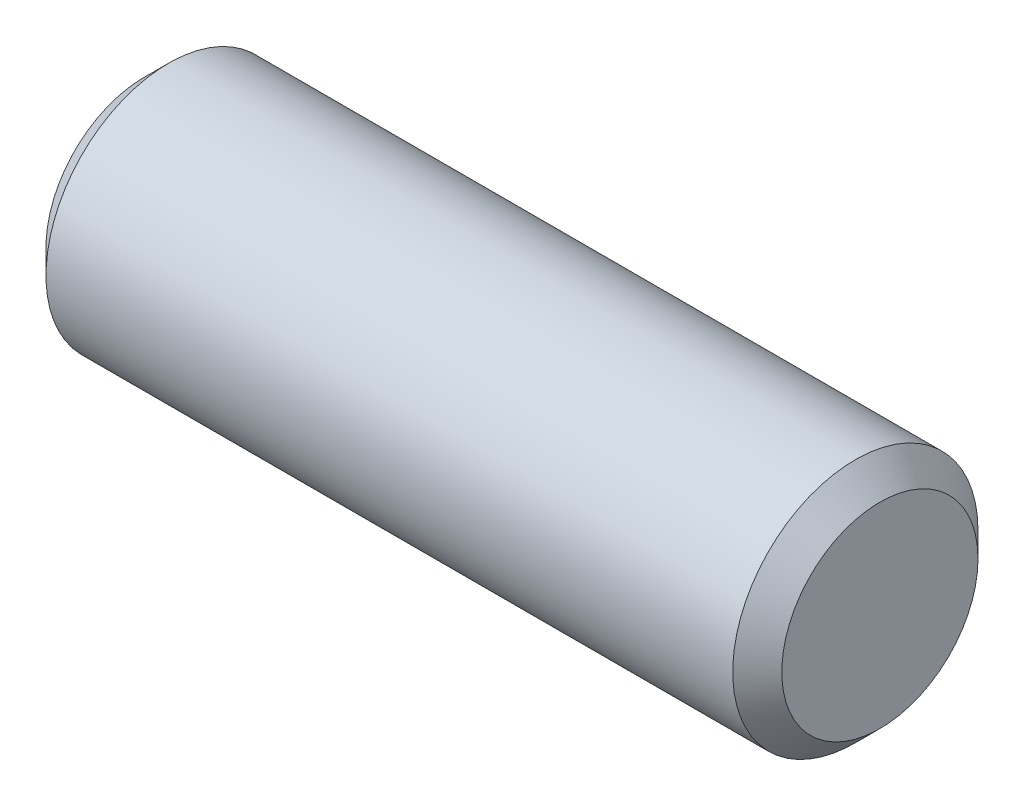
ISO-10303-21;
HEADER;
FILE_DESCRIPTION(('STEP AP214'),'2;1');
FILE_NAME('part.step','',(''),(''),'','','');
FILE_SCHEMA(('AUTOMOTIVE_DESIGN { 1 0 10303 214 1 1 1 1 }'));
ENDSEC;
DATA;
#1=APPLICATION_CONTEXT('core data for automotive mechanical design processes');
#2=APPLICATION_PROTOCOL_DEFINITION('international standard','automotive_design',2000,#1);
#3=PRODUCT_CONTEXT('',#1,'mechanical');
#4=PRODUCT('Part','Part','',(#3));
#5=PRODUCT_RELATED_PRODUCT_CATEGORY('part','',(#4));
#6=PRODUCT_DEFINITION_FORMATION('','',#4);
#7=PRODUCT_DEFINITION_CONTEXT('part definition',#1,'design');
#8=PRODUCT_DEFINITION('design','',#6,#7);
#9=PRODUCT_DEFINITION_SHAPE('','',#8);
#10=(LENGTH_UNIT() NAMED_UNIT(*) SI_UNIT(.MILLI.,.METRE.));
#11=(NAMED_UNIT(*) PLANE_ANGLE_UNIT() SI_UNIT($,.RADIAN.));
#12=(NAMED_UNIT(*) SI_UNIT($,.STERADIAN.) SOLID_ANGLE_UNIT());
#13=UNCERTAINTY_MEASURE_WITH_UNIT(LENGTH_MEASURE(1.E-05),#10,'distance_accuracy_value','');
#14=(GEOMETRIC_REPRESENTATION_CONTEXT(3) GLOBAL_UNCERTAINTY_ASSIGNED_CONTEXT((#13)) GLOBAL_UNIT_ASSIGNED_CONTEXT((#10,
#11,#12)) REPRESENTATION_CONTEXT('',''));
#15=CARTESIAN_POINT('',(0.,0.,0.));
#16=DIRECTION('',(0.,0.,1.));
#17=DIRECTION('',(1.,0.,0.));
#18=AXIS2_PLACEMENT_3D('',#15,#16,#17);
#19=CARTESIAN_POINT('',(-26.7812297777853,1.70199361185072,20.3170127652867));
#20=DIRECTION('',(1.,0.,0.));
#21=DIRECTION('',(0.,0.,-1.));
#22=AXIS2_PLACEMENT_3D('',#19,#20,#21);
#23=CYLINDRICAL_SURFACE('',#22,1.5875);
#24=CARTESIAN_POINT('',(-17.5737297777853,1.70199361185072,20.3170127652868));
#25=DIRECTION('',(1.,0.,0.));
#26=DIRECTION('',(0.,0.,-1.));
#27=AXIS2_PLACEMENT_3D('',#24,#25,#26);
#28=CIRCLE('',#27,1.5875);
#29=CARTESIAN_POINT('',(-17.5737297777853,1.70199361185072,18.7295127652868));
#30=VERTEX_POINT('',#29);
#31=EDGE_CURVE('E45',#30,#30,#28,.F.);
#32=ORIENTED_EDGE('',*,*,#31,.T.);
#33=EDGE_LOOP('',(#32));
#34=FACE_BOUND('',#33,.T.);
#35=CARTESIAN_POINT('',(-26.4637297777852,1.70199361185072,20.3170127652867));
#36=DIRECTION('',(1.,0.,0.));
#37=DIRECTION('',(0.,0.,-1.));
#38=AXIS2_PLACEMENT_3D('',#35,#36,#37);
#39=CIRCLE('',#38,1.5875);
#40=CARTESIAN_POINT('',(-26.4637297777852,1.70199361185072,18.7295127652867));
#41=VERTEX_POINT('',#40);
#42=EDGE_CURVE('E50',#41,#41,#39,.T.);
#43=ORIENTED_EDGE('',*,*,#42,.T.);
#44=EDGE_LOOP('',(#43));
#45=FACE_BOUND('',#44,.T.);
#46=ADVANCED_FACE('F37',(#34,#45),#23,.T.);
#47=CARTESIAN_POINT('',(-26.7812297777853,1.70199361185072,20.3170127652867));
#48=DIRECTION('',(1.,0.,0.));
#49=DIRECTION('',(0.,0.,-1.));
#50=AXIS2_PLACEMENT_3D('',#47,#48,#49);
#51=PLANE('',#50);
#52=CARTESIAN_POINT('',(-26.7812297777853,1.70199361185072,20.3170127652867));
#53=DIRECTION('',(1.,0.,0.));
#54=DIRECTION('',(0.,0.,-1.));
#55=AXIS2_PLACEMENT_3D('',#52,#53,#54);
#56=CIRCLE('',#55,1.27);
#57=CARTESIAN_POINT('',(-26.7812297777853,1.70199361185072,19.0470127652867));
#58=VERTEX_POINT('',#57);
#59=EDGE_CURVE('E10',#58,#58,#56,.F.);
#60=ORIENTED_EDGE('',*,*,#59,.T.);
#61=EDGE_LOOP('',(#60));
#62=FACE_BOUND('',#61,.T.);
#63=ADVANCED_FACE('F72',(#62),#51,.F.);
#64=CARTESIAN_POINT('',(-17.2562297777853,1.70199361185072,20.3170127652868));
#65=DIRECTION('',(1.,0.,0.));
#66=DIRECTION('',(0.,0.,-1.));
#67=AXIS2_PLACEMENT_3D('',#64,#65,#66);
#68=PLANE('',#67);
#69=CARTESIAN_POINT('',(-17.2562297777853,1.70199361185072,20.3170127652868));
#70=DIRECTION('',(1.,0.,0.));
#71=DIRECTION('',(0.,0.,-1.));
#72=AXIS2_PLACEMENT_3D('',#69,#70,#71);
#73=CIRCLE('',#72,1.27);
#74=CARTESIAN_POINT('',(-17.2562297777853,1.70199361185072,19.0470127652868));
#75=VERTEX_POINT('',#74);
#76=EDGE_CURVE('E55',#75,#75,#73,.T.);
#77=ORIENTED_EDGE('',*,*,#76,.T.);
#78=EDGE_LOOP('',(#77));
#79=FACE_BOUND('',#78,.T.);
#80=ADVANCED_FACE('F62',(#79),#68,.T.);
#81=CARTESIAN_POINT('',(-17.2562297777853,1.70199361185072,20.3170127652868));
#82=DIRECTION('',(-1.,0.,0.));
#83=DIRECTION('',(0.,0.,1.));
#84=AXIS2_PLACEMENT_3D('',#81,#82,#83);
#85=CONICAL_SURFACE('',#84,1.27,0.785398163397446);
#86=ORIENTED_EDGE('',*,*,#31,.F.);
#87=EDGE_LOOP('',(#86));
#88=FACE_BOUND('',#87,.T.);
#89=ORIENTED_EDGE('',*,*,#76,.F.);
#90=EDGE_LOOP('',(#89));
#91=FACE_BOUND('',#90,.T.);
#92=ADVANCED_FACE('F64',(#88,#91),#85,.T.);
#93=CARTESIAN_POINT('',(-26.4637297777852,1.70199361185072,20.3170127652867));
#94=DIRECTION('',(1.,0.,0.));
#95=DIRECTION('',(0.,0.,-1.));
#96=AXIS2_PLACEMENT_3D('',#93,#94,#95);
#97=CONICAL_SURFACE('',#96,1.5875,0.78539816339745);
#98=ORIENTED_EDGE('',*,*,#59,.F.);
#99=EDGE_LOOP('',(#98));
#100=FACE_BOUND('',#99,.T.);
#101=ORIENTED_EDGE('',*,*,#42,.F.);
#102=EDGE_LOOP('',(#101));
#103=FACE_BOUND('',#102,.T.);
#104=ADVANCED_FACE('F39',(#100,#103),#97,.T.);
#105=CLOSED_SHELL('',(#46,#63,#80,#92,#104));
#106=MANIFOLD_SOLID_BREP('B2',#105);
#107=ADVANCED_BREP_SHAPE_REPRESENTATION('',(#18,#106),#14);
#108=SHAPE_DEFINITION_REPRESENTATION(#9,#107);
ENDSEC;
END-ISO-10303-21;
